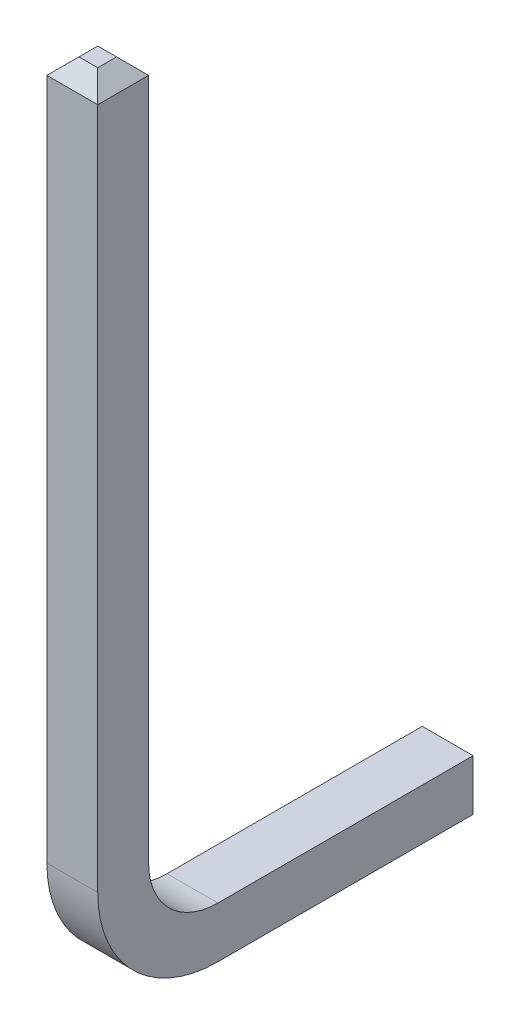
ISO-10303-21;
HEADER;
FILE_DESCRIPTION(('STEP AP214'),'2;1');
FILE_NAME('part.step','',(''),(''),'','','');
FILE_SCHEMA(('AUTOMOTIVE_DESIGN { 1 0 10303 214 1 1 1 1 }'));
ENDSEC;
DATA;
#1=APPLICATION_CONTEXT('core data for automotive mechanical design processes');
#2=APPLICATION_PROTOCOL_DEFINITION('international standard','automotive_design',2000,#1);
#3=PRODUCT_CONTEXT('',#1,'mechanical');
#4=PRODUCT('Part','Part','',(#3));
#5=PRODUCT_RELATED_PRODUCT_CATEGORY('part','',(#4));
#6=PRODUCT_DEFINITION_FORMATION('','',#4);
#7=PRODUCT_DEFINITION_CONTEXT('part definition',#1,'design');
#8=PRODUCT_DEFINITION('design','',#6,#7);
#9=PRODUCT_DEFINITION_SHAPE('','',#8);
#10=(LENGTH_UNIT() NAMED_UNIT(*) SI_UNIT(.MILLI.,.METRE.));
#11=(NAMED_UNIT(*) PLANE_ANGLE_UNIT() SI_UNIT($,.RADIAN.));
#12=(NAMED_UNIT(*) SI_UNIT($,.STERADIAN.) SOLID_ANGLE_UNIT());
#13=UNCERTAINTY_MEASURE_WITH_UNIT(LENGTH_MEASURE(1.E-05),#10,'distance_accuracy_value','');
#14=(GEOMETRIC_REPRESENTATION_CONTEXT(3) GLOBAL_UNCERTAINTY_ASSIGNED_CONTEXT((#13)) GLOBAL_UNIT_ASSIGNED_CONTEXT((#10,
#11,#12)) REPRESENTATION_CONTEXT('',''));
#15=CARTESIAN_POINT('',(0.,0.,0.));
#16=DIRECTION('',(0.,0.,1.));
#17=DIRECTION('',(1.,0.,0.));
#18=AXIS2_PLACEMENT_3D('',#15,#16,#17);
#19=CARTESIAN_POINT('',(-0.635,1.5,-1.5));
#20=DIRECTION('',(1.,0.,0.));
#21=DIRECTION('',(0.,0.,-1.));
#22=AXIS2_PLACEMENT_3D('',#19,#20,#21);
#23=CYLINDRICAL_SURFACE('',#22,1.5);
#24=CARTESIAN_POINT('',(0.,1.5,-1.5));
#25=DIRECTION('',(1.,0.,0.));
#26=DIRECTION('',(0.,0.,-1.));
#27=AXIS2_PLACEMENT_3D('',#24,#25,#26);
#28=CIRCLE('',#27,1.5);
#29=CARTESIAN_POINT('',(0.,1.50000000000001,0.));
#30=VERTEX_POINT('',#29);
#31=CARTESIAN_POINT('',(0.,0.,-1.50000000000001));
#32=VERTEX_POINT('',#31);
#33=EDGE_CURVE('E164',#30,#32,#28,.T.);
#34=ORIENTED_EDGE('',*,*,#33,.F.);
#35=DIRECTION('',(1.,0.,0.));
#36=VECTOR('',#35,1.);
#37=CARTESIAN_POINT('',(-0.635,1.50000000000001,0.));
#38=LINE('',#37,#36);
#39=CARTESIAN_POINT('',(-0.635,1.50000000000001,0.));
#40=VERTEX_POINT('',#39);
#41=EDGE_CURVE('E150',#40,#30,#38,.T.);
#42=ORIENTED_EDGE('',*,*,#41,.F.);
#43=CARTESIAN_POINT('',(-0.635,1.5,-1.5));
#44=DIRECTION('',(1.,0.,0.));
#45=DIRECTION('',(0.,0.,-1.));
#46=AXIS2_PLACEMENT_3D('',#43,#44,#45);
#47=CIRCLE('',#46,1.5);
#48=CARTESIAN_POINT('',(-0.635,0.,-1.50000000000001));
#49=VERTEX_POINT('',#48);
#50=EDGE_CURVE('E142',#40,#49,#47,.T.);
#51=ORIENTED_EDGE('',*,*,#50,.T.);
#52=DIRECTION('',(1.,0.,0.));
#53=VECTOR('',#52,1.);
#54=CARTESIAN_POINT('',(-0.635,0.,-1.50000000000001));
#55=LINE('',#54,#53);
#56=EDGE_CURVE('E124',#49,#32,#55,.T.);
#57=ORIENTED_EDGE('',*,*,#56,.T.);
#58=EDGE_LOOP('',(#34,#42,#51,#57));
#59=FACE_BOUND('',#58,.T.);
#60=ADVANCED_FACE('F34',(#59),#23,.T.);
#61=CARTESIAN_POINT('',(-0.635,10.2175,0.));
#62=DIRECTION('',(0.,0.,1.));
#63=DIRECTION('',(0.,-1.,0.));
#64=AXIS2_PLACEMENT_3D('',#61,#62,#63);
#65=PLANE('',#64);
#66=DIRECTION('',(0.,-1.,0.));
#67=VECTOR('',#66,1.);
#68=CARTESIAN_POINT('',(0.,10.2175,0.));
#69=LINE('',#68,#67);
#70=CARTESIAN_POINT('',(0.,10.0175,0.));
#71=VERTEX_POINT('',#70);
#72=EDGE_CURVE('E151',#71,#30,#69,.T.);
#73=ORIENTED_EDGE('',*,*,#72,.F.);
#74=DIRECTION('',(-1.,0.,0.));
#75=VECTOR('',#74,1.);
#76=CARTESIAN_POINT('',(-0.635,10.0175,0.));
#77=LINE('',#76,#75);
#78=CARTESIAN_POINT('',(-0.635,10.0175,0.));
#79=VERTEX_POINT('',#78);
#80=EDGE_CURVE('E189',#71,#79,#77,.T.);
#81=ORIENTED_EDGE('',*,*,#80,.T.);
#82=DIRECTION('',(0.,-1.,0.));
#83=VECTOR('',#82,1.);
#84=CARTESIAN_POINT('',(-0.635,10.2175,0.));
#85=LINE('',#84,#83);
#86=EDGE_CURVE('E136',#79,#40,#85,.T.);
#87=ORIENTED_EDGE('',*,*,#86,.T.);
#88=ORIENTED_EDGE('',*,*,#41,.T.);
#89=EDGE_LOOP('',(#73,#81,#87,#88));
#90=FACE_BOUND('',#89,.T.);
#91=ADVANCED_FACE('F238',(#90),#65,.T.);
#92=CARTESIAN_POINT('',(-0.635,10.2175,-0.635));
#93=DIRECTION('',(0.,1.,0.));
#94=DIRECTION('',(0.,0.,1.));
#95=AXIS2_PLACEMENT_3D('',#92,#93,#94);
#96=PLANE('',#95);
#97=DIRECTION('',(0.,0.,1.));
#98=VECTOR('',#97,1.);
#99=CARTESIAN_POINT('',(-0.435000000000003,10.2175,0.));
#100=LINE('',#99,#98);
#101=CARTESIAN_POINT('',(-0.435000000000003,10.2175,-0.435000000000003));
#102=VERTEX_POINT('',#101);
#103=CARTESIAN_POINT('',(-0.435000000000003,10.2175,-0.199999999999996));
#104=VERTEX_POINT('',#103);
#105=EDGE_CURVE('E184',#102,#104,#100,.T.);
#106=ORIENTED_EDGE('',*,*,#105,.T.);
#107=DIRECTION('',(1.,0.,0.));
#108=VECTOR('',#107,1.);
#109=CARTESIAN_POINT('',(-0.635,10.2175,-0.199999999999996));
#110=LINE('',#109,#108);
#111=CARTESIAN_POINT('',(-0.199999999999997,10.2175,-0.199999999999996));
#112=VERTEX_POINT('',#111);
#113=EDGE_CURVE('E186',#104,#112,#110,.T.);
#114=ORIENTED_EDGE('',*,*,#113,.T.);
#115=DIRECTION('',(0.,0.,-1.));
#116=VECTOR('',#115,1.);
#117=CARTESIAN_POINT('',(-0.199999999999997,10.2175,-0.635));
#118=LINE('',#117,#116);
#119=CARTESIAN_POINT('',(-0.199999999999997,10.2175,-0.435000000000003));
#120=VERTEX_POINT('',#119);
#121=EDGE_CURVE('E176',#112,#120,#118,.T.);
#122=ORIENTED_EDGE('',*,*,#121,.T.);
#123=DIRECTION('',(-1.,0.,0.));
#124=VECTOR('',#123,1.);
#125=CARTESIAN_POINT('',(-0.635,10.2175,-0.435000000000003));
#126=LINE('',#125,#124);
#127=EDGE_CURVE('E182',#120,#102,#126,.T.);
#128=ORIENTED_EDGE('',*,*,#127,.T.);
#129=EDGE_LOOP('',(#106,#114,#122,#128));
#130=FACE_BOUND('',#129,.T.);
#131=ADVANCED_FACE('F257',(#130),#96,.T.);
#132=CARTESIAN_POINT('',(-0.635,1.5,-0.635));
#133=DIRECTION('',(0.,0.,-1.));
#134=DIRECTION('',(-1.,0.,0.));
#135=AXIS2_PLACEMENT_3D('',#132,#133,#134);
#136=PLANE('',#135);
#137=DIRECTION('',(0.,1.,0.));
#138=VECTOR('',#137,1.);
#139=CARTESIAN_POINT('',(-0.635,1.5,-0.635));
#140=LINE('',#139,#138);
#141=CARTESIAN_POINT('',(-0.635,1.5,-0.635));
#142=VERTEX_POINT('',#141);
#143=CARTESIAN_POINT('',(-0.635,10.0175,-0.635));
#144=VERTEX_POINT('',#143);
#145=EDGE_CURVE('E160',#142,#144,#140,.T.);
#146=ORIENTED_EDGE('',*,*,#145,.T.);
#147=DIRECTION('',(1.,0.,0.));
#148=VECTOR('',#147,1.);
#149=CARTESIAN_POINT('',(-0.635,10.0175,-0.635));
#150=LINE('',#149,#148);
#151=CARTESIAN_POINT('',(0.,10.0175,-0.635));
#152=VERTEX_POINT('',#151);
#153=EDGE_CURVE('E195',#144,#152,#150,.T.);
#154=ORIENTED_EDGE('',*,*,#153,.T.);
#155=DIRECTION('',(0.,1.,0.));
#156=VECTOR('',#155,1.);
#157=CARTESIAN_POINT('',(0.,1.5,-0.635));
#158=LINE('',#157,#156);
#159=CARTESIAN_POINT('',(0.,1.5,-0.635));
#160=VERTEX_POINT('',#159);
#161=EDGE_CURVE('E153',#160,#152,#158,.T.);
#162=ORIENTED_EDGE('',*,*,#161,.F.);
#163=DIRECTION('',(1.,0.,0.));
#164=VECTOR('',#163,1.);
#165=CARTESIAN_POINT('',(-0.635,1.5,-0.635));
#166=LINE('',#165,#164);
#167=EDGE_CURVE('E177',#142,#160,#166,.T.);
#168=ORIENTED_EDGE('',*,*,#167,.F.);
#169=EDGE_LOOP('',(#146,#154,#162,#168));
#170=FACE_BOUND('',#169,.T.);
#171=ADVANCED_FACE('F246',(#170),#136,.T.);
#172=CARTESIAN_POINT('',(-0.635,1.5,-1.5));
#173=DIRECTION('',(1.,0.,0.));
#174=DIRECTION('',(0.,0.,-1.));
#175=AXIS2_PLACEMENT_3D('',#172,#173,#174);
#176=CYLINDRICAL_SURFACE('',#175,0.865);
#177=CARTESIAN_POINT('',(0.,1.5,-1.5));
#178=DIRECTION('',(-1.,0.,0.));
#179=DIRECTION('',(0.,0.,1.));
#180=AXIS2_PLACEMENT_3D('',#177,#178,#179);
#181=CIRCLE('',#180,0.865);
#182=CARTESIAN_POINT('',(0.,0.635,-1.5));
#183=VERTEX_POINT('',#182);
#184=EDGE_CURVE('E170',#183,#160,#181,.T.);
#185=ORIENTED_EDGE('',*,*,#184,.F.);
#186=DIRECTION('',(1.,0.,0.));
#187=VECTOR('',#186,1.);
#188=CARTESIAN_POINT('',(-0.635,0.635,-1.5));
#189=LINE('',#188,#187);
#190=CARTESIAN_POINT('',(-0.635,0.635,-1.5));
#191=VERTEX_POINT('',#190);
#192=EDGE_CURVE('E135',#191,#183,#189,.T.);
#193=ORIENTED_EDGE('',*,*,#192,.F.);
#194=CARTESIAN_POINT('',(-0.635,1.5,-1.5));
#195=DIRECTION('',(-1.,0.,0.));
#196=DIRECTION('',(0.,0.,1.));
#197=AXIS2_PLACEMENT_3D('',#194,#195,#196);
#198=CIRCLE('',#197,0.865);
#199=EDGE_CURVE('E157',#191,#142,#198,.T.);
#200=ORIENTED_EDGE('',*,*,#199,.T.);
#201=ORIENTED_EDGE('',*,*,#167,.T.);
#202=EDGE_LOOP('',(#185,#193,#200,#201));
#203=FACE_BOUND('',#202,.T.);
#204=ADVANCED_FACE('F286',(#203),#176,.F.);
#205=CARTESIAN_POINT('',(-0.635,0.635,-4.887));
#206=DIRECTION('',(0.,1.,0.));
#207=DIRECTION('',(0.,0.,1.));
#208=AXIS2_PLACEMENT_3D('',#205,#206,#207);
#209=PLANE('',#208);
#210=DIRECTION('',(0.,0.,1.));
#211=VECTOR('',#210,1.);
#212=CARTESIAN_POINT('',(0.,0.635,-4.887));
#213=LINE('',#212,#211);
#214=CARTESIAN_POINT('',(0.,0.635,-4.687));
#215=VERTEX_POINT('',#214);
#216=EDGE_CURVE('E168',#215,#183,#213,.T.);
#217=ORIENTED_EDGE('',*,*,#216,.F.);
#218=DIRECTION('',(-1.,0.,0.));
#219=VECTOR('',#218,1.);
#220=CARTESIAN_POINT('',(-0.635,0.635,-4.687));
#221=LINE('',#220,#219);
#222=CARTESIAN_POINT('',(-0.635,0.635,-4.687));
#223=VERTEX_POINT('',#222);
#224=EDGE_CURVE('E43',#215,#223,#221,.T.);
#225=ORIENTED_EDGE('',*,*,#224,.T.);
#226=DIRECTION('',(0.,0.,1.));
#227=VECTOR('',#226,1.);
#228=CARTESIAN_POINT('',(-0.635,0.635,-4.887));
#229=LINE('',#228,#227);
#230=EDGE_CURVE('E146',#223,#191,#229,.T.);
#231=ORIENTED_EDGE('',*,*,#230,.T.);
#232=ORIENTED_EDGE('',*,*,#192,.T.);
#233=EDGE_LOOP('',(#217,#225,#231,#232));
#234=FACE_BOUND('',#233,.T.);
#235=ADVANCED_FACE('F283',(#234),#209,.T.);
#236=CARTESIAN_POINT('',(-0.635,0.,-4.887));
#237=DIRECTION('',(0.,0.,-1.));
#238=DIRECTION('',(-1.,0.,0.));
#239=AXIS2_PLACEMENT_3D('',#236,#237,#238);
#240=PLANE('',#239);
#241=DIRECTION('',(0.,1.,0.));
#242=VECTOR('',#241,1.);
#243=CARTESIAN_POINT('',(-0.434999999999998,0.635,-4.887));
#244=LINE('',#243,#242);
#245=CARTESIAN_POINT('',(-0.434999999999998,0.200000000000002,-4.887));
#246=VERTEX_POINT('',#245);
#247=CARTESIAN_POINT('',(-0.434999999999998,0.434999999999998,-4.887));
#248=VERTEX_POINT('',#247);
#249=EDGE_CURVE('E51',#246,#248,#244,.T.);
#250=ORIENTED_EDGE('',*,*,#249,.T.);
#251=DIRECTION('',(1.,0.,0.));
#252=VECTOR('',#251,1.);
#253=CARTESIAN_POINT('',(-0.635,0.434999999999998,-4.887));
#254=LINE('',#253,#252);
#255=CARTESIAN_POINT('',(-0.200000000000002,0.434999999999998,-4.887));
#256=VERTEX_POINT('',#255);
#257=EDGE_CURVE('E205',#248,#256,#254,.T.);
#258=ORIENTED_EDGE('',*,*,#257,.T.);
#259=DIRECTION('',(0.,-1.,0.));
#260=VECTOR('',#259,1.);
#261=CARTESIAN_POINT('',(-0.200000000000002,0.,-4.887));
#262=LINE('',#261,#260);
#263=CARTESIAN_POINT('',(-0.200000000000002,0.200000000000002,-4.887));
#264=VERTEX_POINT('',#263);
#265=EDGE_CURVE('E201',#256,#264,#262,.T.);
#266=ORIENTED_EDGE('',*,*,#265,.T.);
#267=DIRECTION('',(-1.,0.,0.));
#268=VECTOR('',#267,1.);
#269=CARTESIAN_POINT('',(-0.635,0.200000000000002,-4.887));
#270=LINE('',#269,#268);
#271=EDGE_CURVE('E56',#264,#246,#270,.T.);
#272=ORIENTED_EDGE('',*,*,#271,.T.);
#273=EDGE_LOOP('',(#250,#258,#266,#272));
#274=FACE_BOUND('',#273,.T.);
#275=ADVANCED_FACE('F280',(#274),#240,.T.);
#276=CARTESIAN_POINT('',(-0.635,0.,-1.50000000000001));
#277=DIRECTION('',(0.,-1.,0.));
#278=DIRECTION('',(0.,0.,-1.));
#279=AXIS2_PLACEMENT_3D('',#276,#277,#278);
#280=PLANE('',#279);
#281=DIRECTION('',(0.,0.,-1.));
#282=VECTOR('',#281,1.);
#283=CARTESIAN_POINT('',(-0.635,0.,-1.50000000000001));
#284=LINE('',#283,#282);
#285=CARTESIAN_POINT('',(-0.635,0.,-4.687));
#286=VERTEX_POINT('',#285);
#287=EDGE_CURVE('E127',#49,#286,#284,.T.);
#288=ORIENTED_EDGE('',*,*,#287,.T.);
#289=DIRECTION('',(1.,0.,0.));
#290=VECTOR('',#289,1.);
#291=CARTESIAN_POINT('',(-0.635,0.,-4.687));
#292=LINE('',#291,#290);
#293=CARTESIAN_POINT('',(0.,0.,-4.687));
#294=VERTEX_POINT('',#293);
#295=EDGE_CURVE('E11',#286,#294,#292,.T.);
#296=ORIENTED_EDGE('',*,*,#295,.T.);
#297=DIRECTION('',(0.,0.,-1.));
#298=VECTOR('',#297,1.);
#299=CARTESIAN_POINT('',(0.,0.,-1.50000000000001));
#300=LINE('',#299,#298);
#301=EDGE_CURVE('E130',#32,#294,#300,.T.);
#302=ORIENTED_EDGE('',*,*,#301,.F.);
#303=ORIENTED_EDGE('',*,*,#56,.F.);
#304=EDGE_LOOP('',(#288,#296,#302,#303));
#305=FACE_BOUND('',#304,.T.);
#306=ADVANCED_FACE('F126',(#305),#280,.T.);
#307=CARTESIAN_POINT('',(-0.635,1.5,-1.5));
#308=DIRECTION('',(1.,0.,0.));
#309=DIRECTION('',(0.,0.,-1.));
#310=AXIS2_PLACEMENT_3D('',#307,#308,#309);
#311=PLANE('',#310);
#312=ORIENTED_EDGE('',*,*,#86,.F.);
#313=DIRECTION('',(0.,0.,-1.));
#314=VECTOR('',#313,1.);
#315=CARTESIAN_POINT('',(-0.635,10.0175,-0.635));
#316=LINE('',#315,#314);
#317=EDGE_CURVE('E193',#79,#144,#316,.T.);
#318=ORIENTED_EDGE('',*,*,#317,.T.);
#319=ORIENTED_EDGE('',*,*,#145,.F.);
#320=ORIENTED_EDGE('',*,*,#199,.F.);
#321=ORIENTED_EDGE('',*,*,#230,.F.);
#322=DIRECTION('',(0.,-1.,0.));
#323=VECTOR('',#322,1.);
#324=CARTESIAN_POINT('',(-0.635,0.,-4.687));
#325=LINE('',#324,#323);
#326=EDGE_CURVE('E145',#223,#286,#325,.T.);
#327=ORIENTED_EDGE('',*,*,#326,.T.);
#328=ORIENTED_EDGE('',*,*,#287,.F.);
#329=ORIENTED_EDGE('',*,*,#50,.F.);
#330=EDGE_LOOP('',(#312,#318,#319,#320,#321,#327,#328,#329));
#331=FACE_BOUND('',#330,.T.);
#332=ADVANCED_FACE('F141',(#331),#311,.F.);
#333=CARTESIAN_POINT('',(0.,1.5,-1.5));
#334=DIRECTION('',(1.,0.,0.));
#335=DIRECTION('',(0.,0.,-1.));
#336=AXIS2_PLACEMENT_3D('',#333,#334,#335);
#337=PLANE('',#336);
#338=ORIENTED_EDGE('',*,*,#161,.T.);
#339=DIRECTION('',(0.,0.,1.));
#340=VECTOR('',#339,1.);
#341=CARTESIAN_POINT('',(0.,10.0175,-1.5));
#342=LINE('',#341,#340);
#343=EDGE_CURVE('E199',#152,#71,#342,.T.);
#344=ORIENTED_EDGE('',*,*,#343,.T.);
#345=ORIENTED_EDGE('',*,*,#72,.T.);
#346=ORIENTED_EDGE('',*,*,#33,.T.);
#347=ORIENTED_EDGE('',*,*,#301,.T.);
#348=DIRECTION('',(0.,1.,0.));
#349=VECTOR('',#348,1.);
#350=CARTESIAN_POINT('',(0.,1.5,-4.687));
#351=LINE('',#350,#349);
#352=EDGE_CURVE('E197',#294,#215,#351,.T.);
#353=ORIENTED_EDGE('',*,*,#352,.T.);
#354=ORIENTED_EDGE('',*,*,#216,.T.);
#355=ORIENTED_EDGE('',*,*,#184,.T.);
#356=EDGE_LOOP('',(#338,#344,#345,#346,#347,#353,#354,#355));
#357=FACE_BOUND('',#356,.T.);
#358=ADVANCED_FACE('F232',(#357),#337,.T.);
#359=CARTESIAN_POINT('',(-0.635,10.0175,-0.635));
#360=DIRECTION('',(0.,-0.707106781186548,0.707106781186548));
#361=DIRECTION('',(1.,0.,0.));
#362=AXIS2_PLACEMENT_3D('',#359,#360,#361);
#363=PLANE('',#362);
#364=DIRECTION('',(-0.577350269189626,0.577350269189626,0.577350269189626));
#365=VECTOR('',#364,1.);
#366=CARTESIAN_POINT('',(0.288333333333333,9.72916666666667,-0.923333333333333));
#367=LINE('',#366,#365);
#368=EDGE_CURVE('E213',#152,#120,#367,.T.);
#369=ORIENTED_EDGE('',*,*,#368,.F.);
#370=ORIENTED_EDGE('',*,*,#153,.F.);
#371=DIRECTION('',(-0.577350269189626,-0.577350269189626,-0.577350269189626));
#372=VECTOR('',#371,1.);
#373=CARTESIAN_POINT('',(-0.635,10.0175,-0.635));
#374=LINE('',#373,#372);
#375=EDGE_CURVE('E166',#102,#144,#374,.T.);
#376=ORIENTED_EDGE('',*,*,#375,.F.);
#377=ORIENTED_EDGE('',*,*,#127,.F.);
#378=EDGE_LOOP('',(#369,#370,#376,#377));
#379=FACE_BOUND('',#378,.T.);
#380=ADVANCED_FACE('F251',(#379),#363,.F.);
#381=CARTESIAN_POINT('',(-0.435000000000003,10.2175,-0.635));
#382=DIRECTION('',(-0.707106781186548,0.707106781186548,0.));
#383=DIRECTION('',(0.,0.,-1.));
#384=AXIS2_PLACEMENT_3D('',#381,#382,#383);
#385=PLANE('',#384);
#386=ORIENTED_EDGE('',*,*,#375,.T.);
#387=ORIENTED_EDGE('',*,*,#317,.F.);
#388=DIRECTION('',(-0.577350269189626,-0.577350269189626,0.577350269189626));
#389=VECTOR('',#388,1.);
#390=CARTESIAN_POINT('',(-0.290000000000002,10.3625,-0.344999999999997));
#391=LINE('',#390,#389);
#392=EDGE_CURVE('E211',#104,#79,#391,.T.);
#393=ORIENTED_EDGE('',*,*,#392,.F.);
#394=ORIENTED_EDGE('',*,*,#105,.F.);
#395=EDGE_LOOP('',(#386,#387,#393,#394));
#396=FACE_BOUND('',#395,.T.);
#397=ADVANCED_FACE('F254',(#396),#385,.T.);
#398=CARTESIAN_POINT('',(0.,10.0175,-1.5));
#399=DIRECTION('',(-0.707106781186548,-0.707106781186548,0.));
#400=DIRECTION('',(0.,0.,1.));
#401=AXIS2_PLACEMENT_3D('',#398,#399,#400);
#402=PLANE('',#401);
#403=ORIENTED_EDGE('',*,*,#368,.T.);
#404=ORIENTED_EDGE('',*,*,#121,.F.);
#405=DIRECTION('',(0.577350269189626,-0.577350269189626,0.577350269189626));
#406=VECTOR('',#405,1.);
#407=CARTESIAN_POINT('',(-0.5,10.5175,-0.499999999999999));
#408=LINE('',#407,#406);
#409=EDGE_CURVE('E209',#71,#112,#408,.F.);
#410=ORIENTED_EDGE('',*,*,#409,.F.);
#411=ORIENTED_EDGE('',*,*,#343,.F.);
#412=EDGE_LOOP('',(#403,#404,#410,#411));
#413=FACE_BOUND('',#412,.T.);
#414=ADVANCED_FACE('F260',(#413),#402,.F.);
#415=CARTESIAN_POINT('',(-0.635,10.2175,-0.199999999999996));
#416=DIRECTION('',(0.,-0.707106781186547,-0.707106781186548));
#417=DIRECTION('',(1.,0.,0.));
#418=AXIS2_PLACEMENT_3D('',#415,#416,#417);
#419=PLANE('',#418);
#420=ORIENTED_EDGE('',*,*,#392,.T.);
#421=ORIENTED_EDGE('',*,*,#80,.F.);
#422=ORIENTED_EDGE('',*,*,#409,.T.);
#423=ORIENTED_EDGE('',*,*,#113,.F.);
#424=EDGE_LOOP('',(#420,#421,#422,#423));
#425=FACE_BOUND('',#424,.T.);
#426=ADVANCED_FACE('F263',(#425),#419,.F.);
#427=CARTESIAN_POINT('',(-0.635,0.,-4.687));
#428=DIRECTION('',(0.,0.707106781186544,0.707106781186551));
#429=DIRECTION('',(1.,0.,0.));
#430=AXIS2_PLACEMENT_3D('',#427,#428,#429);
#431=PLANE('',#430);
#432=DIRECTION('',(-0.577350269189627,0.577350269189627,-0.577350269189622));
#433=VECTOR('',#432,1.);
#434=CARTESIAN_POINT('',(-0.500000000000003,0.500000000000003,-5.187));
#435=LINE('',#434,#433);
#436=EDGE_CURVE('E221',#294,#264,#435,.T.);
#437=ORIENTED_EDGE('',*,*,#436,.F.);
#438=ORIENTED_EDGE('',*,*,#295,.F.);
#439=DIRECTION('',(-0.577350269189627,-0.577350269189627,0.577350269189622));
#440=VECTOR('',#439,1.);
#441=CARTESIAN_POINT('',(-0.635,0.,-4.687));
#442=LINE('',#441,#440);
#443=EDGE_CURVE('E38',#246,#286,#442,.T.);
#444=ORIENTED_EDGE('',*,*,#443,.F.);
#445=ORIENTED_EDGE('',*,*,#271,.F.);
#446=EDGE_LOOP('',(#437,#438,#444,#445));
#447=FACE_BOUND('',#446,.T.);
#448=ADVANCED_FACE('F36',(#447),#431,.F.);
#449=CARTESIAN_POINT('',(-0.434999999999998,0.,-4.887));
#450=DIRECTION('',(-0.707106781186544,0.,-0.707106781186551));
#451=DIRECTION('',(0.,-1.,0.));
#452=AXIS2_PLACEMENT_3D('',#449,#450,#451);
#453=PLANE('',#452);
#454=ORIENTED_EDGE('',*,*,#443,.T.);
#455=ORIENTED_EDGE('',*,*,#326,.F.);
#456=DIRECTION('',(-0.577350269189627,0.577350269189627,0.577350269189622));
#457=VECTOR('',#456,1.);
#458=CARTESIAN_POINT('',(-0.289999999999998,0.289999999999998,-5.032));
#459=LINE('',#458,#457);
#460=EDGE_CURVE('E220',#248,#223,#459,.T.);
#461=ORIENTED_EDGE('',*,*,#460,.F.);
#462=ORIENTED_EDGE('',*,*,#249,.F.);
#463=EDGE_LOOP('',(#454,#455,#461,#462));
#464=FACE_BOUND('',#463,.T.);
#465=ADVANCED_FACE('F229',(#464),#453,.T.);
#466=CARTESIAN_POINT('',(0.,1.5,-4.687));
#467=DIRECTION('',(-0.707106781186544,0.,0.707106781186551));
#468=DIRECTION('',(0.,1.,0.));
#469=AXIS2_PLACEMENT_3D('',#466,#467,#468);
#470=PLANE('',#469);
#471=ORIENTED_EDGE('',*,*,#436,.T.);
#472=ORIENTED_EDGE('',*,*,#265,.F.);
#473=DIRECTION('',(0.577350269189627,0.577350269189627,0.577350269189622));
#474=VECTOR('',#473,1.);
#475=CARTESIAN_POINT('',(0.288333333333335,0.923333333333335,-4.39866666666667));
#476=LINE('',#475,#474);
#477=EDGE_CURVE('E218',#215,#256,#476,.F.);
#478=ORIENTED_EDGE('',*,*,#477,.F.);
#479=ORIENTED_EDGE('',*,*,#352,.F.);
#480=EDGE_LOOP('',(#471,#472,#478,#479));
#481=FACE_BOUND('',#480,.T.);
#482=ADVANCED_FACE('F341',(#481),#470,.F.);
#483=CARTESIAN_POINT('',(-0.635,0.434999999999998,-4.887));
#484=DIRECTION('',(0.,-0.707106781186544,0.707106781186551));
#485=DIRECTION('',(1.,0.,0.));
#486=AXIS2_PLACEMENT_3D('',#483,#484,#485);
#487=PLANE('',#486);
#488=ORIENTED_EDGE('',*,*,#460,.T.);
#489=ORIENTED_EDGE('',*,*,#224,.F.);
#490=ORIENTED_EDGE('',*,*,#477,.T.);
#491=ORIENTED_EDGE('',*,*,#257,.F.);
#492=EDGE_LOOP('',(#488,#489,#490,#491));
#493=FACE_BOUND('',#492,.T.);
#494=ADVANCED_FACE('F349',(#493),#487,.F.);
#495=CLOSED_SHELL('',(#60,#91,#131,#171,#204,#235,#275,#306,#332,#358,#380,#397,#414,#426,#448,
#465,#482,#494));
#496=MANIFOLD_SOLID_BREP('B2',#495);
#497=ADVANCED_BREP_SHAPE_REPRESENTATION('',(#18,#496),#14);
#498=SHAPE_DEFINITION_REPRESENTATION(#9,#497);
ENDSEC;
END-ISO-10303-21;
